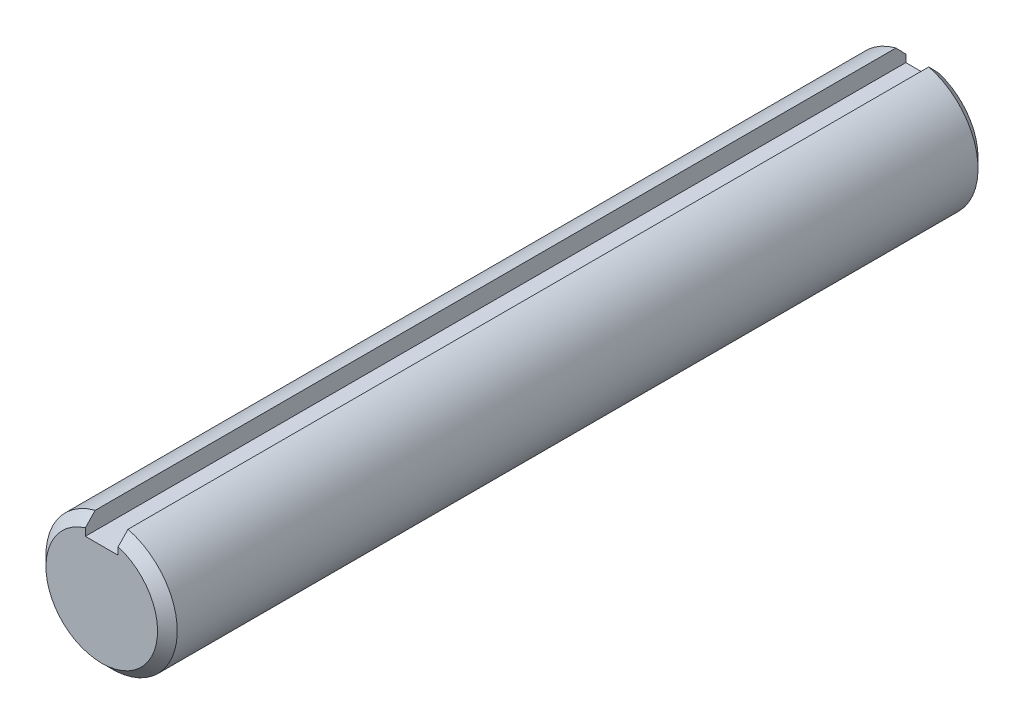
ISO-10303-21;
HEADER;
FILE_DESCRIPTION(('STEP AP214'),'2;1');
FILE_NAME('part.step','',(''),(''),'','','');
FILE_SCHEMA(('AUTOMOTIVE_DESIGN { 1 0 10303 214 1 1 1 1 }'));
ENDSEC;
DATA;
#1=APPLICATION_CONTEXT('core data for automotive mechanical design processes');
#2=APPLICATION_PROTOCOL_DEFINITION('international standard','automotive_design',2000,#1);
#3=PRODUCT_CONTEXT('',#1,'mechanical');
#4=PRODUCT('Part','Part','',(#3));
#5=PRODUCT_RELATED_PRODUCT_CATEGORY('part','',(#4));
#6=PRODUCT_DEFINITION_FORMATION('','',#4);
#7=PRODUCT_DEFINITION_CONTEXT('part definition',#1,'design');
#8=PRODUCT_DEFINITION('design','',#6,#7);
#9=PRODUCT_DEFINITION_SHAPE('','',#8);
#10=(LENGTH_UNIT() NAMED_UNIT(*) SI_UNIT(.MILLI.,.METRE.));
#11=(NAMED_UNIT(*) PLANE_ANGLE_UNIT() SI_UNIT($,.RADIAN.));
#12=(NAMED_UNIT(*) SI_UNIT($,.STERADIAN.) SOLID_ANGLE_UNIT());
#13=UNCERTAINTY_MEASURE_WITH_UNIT(LENGTH_MEASURE(1.E-05),#10,'distance_accuracy_value','');
#14=(GEOMETRIC_REPRESENTATION_CONTEXT(3) GLOBAL_UNCERTAINTY_ASSIGNED_CONTEXT((#13)) GLOBAL_UNIT_ASSIGNED_CONTEXT((#10,
#11,#12)) REPRESENTATION_CONTEXT('',''));
#15=CARTESIAN_POINT('',(0.,0.,0.));
#16=DIRECTION('',(0.,0.,1.));
#17=DIRECTION('',(1.,0.,0.));
#18=AXIS2_PLACEMENT_3D('',#15,#16,#17);
#19=CARTESIAN_POINT('',(0.,0.,25.));
#20=DIRECTION('',(0.,0.,-1.));
#21=DIRECTION('',(-1.,0.,0.));
#22=AXIS2_PLACEMENT_3D('',#19,#20,#21);
#23=CYLINDRICAL_SURFACE('',#22,4.);
#24=CARTESIAN_POINT('',(0.,0.,24.4));
#25=DIRECTION('',(0.,0.,1.));
#26=DIRECTION('',(1.,0.,0.));
#27=AXIS2_PLACEMENT_3D('',#24,#25,#26);
#28=CIRCLE('',#27,4.);
#29=CARTESIAN_POINT('',(1.,3.87298334620742,24.4));
#30=VERTEX_POINT('',#29);
#31=CARTESIAN_POINT('',(-1.,3.87298334620742,24.4));
#32=VERTEX_POINT('',#31);
#33=EDGE_CURVE('E154',#30,#32,#28,.F.);
#34=ORIENTED_EDGE('',*,*,#33,.T.);
#35=DIRECTION('',(0.,0.,-1.));
#36=VECTOR('',#35,1.);
#37=CARTESIAN_POINT('',(-1.,3.87298334620742,25.));
#38=LINE('',#37,#36);
#39=CARTESIAN_POINT('',(-1.,3.87298334620742,-24.4));
#40=VERTEX_POINT('',#39);
#41=EDGE_CURVE('E131',#32,#40,#38,.T.);
#42=ORIENTED_EDGE('',*,*,#41,.T.);
#43=CARTESIAN_POINT('',(0.,0.,-24.4));
#44=DIRECTION('',(0.,0.,1.));
#45=DIRECTION('',(1.,0.,0.));
#46=AXIS2_PLACEMENT_3D('',#43,#44,#45);
#47=CIRCLE('',#46,4.);
#48=CARTESIAN_POINT('',(1.,3.87298334620742,-24.4));
#49=VERTEX_POINT('',#48);
#50=EDGE_CURVE('E151',#40,#49,#47,.T.);
#51=ORIENTED_EDGE('',*,*,#50,.T.);
#52=DIRECTION('',(0.,0.,-1.));
#53=VECTOR('',#52,1.);
#54=CARTESIAN_POINT('',(1.,3.87298334620742,25.));
#55=LINE('',#54,#53);
#56=EDGE_CURVE('E120',#49,#30,#55,.F.);
#57=ORIENTED_EDGE('',*,*,#56,.T.);
#58=EDGE_LOOP('',(#34,#42,#51,#57));
#59=FACE_BOUND('',#58,.T.);
#60=ADVANCED_FACE('F34',(#59),#23,.T.);
#61=CARTESIAN_POINT('',(0.,0.,25.));
#62=DIRECTION('',(0.,0.,1.));
#63=DIRECTION('',(1.,0.,0.));
#64=AXIS2_PLACEMENT_3D('',#61,#62,#63);
#65=PLANE('',#64);
#66=DIRECTION('',(0.,-1.,0.));
#67=VECTOR('',#66,1.);
#68=CARTESIAN_POINT('',(-1.,4.,25.));
#69=LINE('',#68,#67);
#70=CARTESIAN_POINT('',(-1.,3.24961536185438,25.));
#71=VERTEX_POINT('',#70);
#72=CARTESIAN_POINT('',(-1.,2.8,25.));
#73=VERTEX_POINT('',#72);
#74=EDGE_CURVE('E90',#71,#73,#69,.T.);
#75=ORIENTED_EDGE('',*,*,#74,.F.);
#76=CARTESIAN_POINT('',(0.,0.,25.));
#77=DIRECTION('',(0.,0.,1.));
#78=DIRECTION('',(1.,0.,0.));
#79=AXIS2_PLACEMENT_3D('',#76,#77,#78);
#80=CIRCLE('',#79,3.4);
#81=CARTESIAN_POINT('',(1.,3.24961536185438,25.));
#82=VERTEX_POINT('',#81);
#83=EDGE_CURVE('E146',#71,#82,#80,.T.);
#84=ORIENTED_EDGE('',*,*,#83,.T.);
#85=DIRECTION('',(0.,1.,0.));
#86=VECTOR('',#85,1.);
#87=CARTESIAN_POINT('',(1.,4.,25.));
#88=LINE('',#87,#86);
#89=CARTESIAN_POINT('',(1.,2.8,25.));
#90=VERTEX_POINT('',#89);
#91=EDGE_CURVE('E55',#90,#82,#88,.T.);
#92=ORIENTED_EDGE('',*,*,#91,.F.);
#93=DIRECTION('',(1.,0.,0.));
#94=VECTOR('',#93,1.);
#95=CARTESIAN_POINT('',(-1.,2.8,25.));
#96=LINE('',#95,#94);
#97=EDGE_CURVE('E100',#73,#90,#96,.T.);
#98=ORIENTED_EDGE('',*,*,#97,.F.);
#99=EDGE_LOOP('',(#75,#84,#92,#98));
#100=FACE_BOUND('',#99,.T.);
#101=ADVANCED_FACE('F111',(#100),#65,.T.);
#102=CARTESIAN_POINT('',(0.,0.,-25.));
#103=DIRECTION('',(0.,0.,1.));
#104=DIRECTION('',(1.,0.,0.));
#105=AXIS2_PLACEMENT_3D('',#102,#103,#104);
#106=PLANE('',#105);
#107=CARTESIAN_POINT('',(0.,0.,-25.));
#108=DIRECTION('',(0.,0.,1.));
#109=DIRECTION('',(1.,0.,0.));
#110=AXIS2_PLACEMENT_3D('',#107,#108,#109);
#111=CIRCLE('',#110,3.39999999999999);
#112=CARTESIAN_POINT('',(1.,3.24961536185438,-25.));
#113=VERTEX_POINT('',#112);
#114=CARTESIAN_POINT('',(-1.,3.24961536185438,-25.));
#115=VERTEX_POINT('',#114);
#116=EDGE_CURVE('E148',#113,#115,#111,.F.);
#117=ORIENTED_EDGE('',*,*,#116,.T.);
#118=DIRECTION('',(0.,-1.,0.));
#119=VECTOR('',#118,1.);
#120=CARTESIAN_POINT('',(-1.,4.,-25.));
#121=LINE('',#120,#119);
#122=CARTESIAN_POINT('',(-1.,2.8,-25.));
#123=VERTEX_POINT('',#122);
#124=EDGE_CURVE('E113',#115,#123,#121,.T.);
#125=ORIENTED_EDGE('',*,*,#124,.T.);
#126=DIRECTION('',(1.,0.,0.));
#127=VECTOR('',#126,1.);
#128=CARTESIAN_POINT('',(-1.,2.8,-25.));
#129=LINE('',#128,#127);
#130=CARTESIAN_POINT('',(1.,2.8,-25.));
#131=VERTEX_POINT('',#130);
#132=EDGE_CURVE('E106',#123,#131,#129,.T.);
#133=ORIENTED_EDGE('',*,*,#132,.T.);
#134=DIRECTION('',(0.,1.,0.));
#135=VECTOR('',#134,1.);
#136=CARTESIAN_POINT('',(1.,4.,-25.));
#137=LINE('',#136,#135);
#138=EDGE_CURVE('E109',#131,#113,#137,.T.);
#139=ORIENTED_EDGE('',*,*,#138,.T.);
#140=EDGE_LOOP('',(#117,#125,#133,#139));
#141=FACE_BOUND('',#140,.T.);
#142=ADVANCED_FACE('F166',(#141),#106,.F.);
#143=CARTESIAN_POINT('',(0.,0.,-24.4));
#144=DIRECTION('',(0.,0.,1.));
#145=DIRECTION('',(1.,0.,0.));
#146=AXIS2_PLACEMENT_3D('',#143,#144,#145);
#147=CONICAL_SURFACE('',#146,4.,0.785398163397451);
#148=CARTESIAN_POINT('',(-1.,1.35081586044512,-26.7193145776707));
#149=CARTESIAN_POINT('',(-1.,1.41488066306062,-26.6677819180892));
#150=CARTESIAN_POINT('',(-1.,1.47834718315388,-26.6155190121442));
#151=CARTESIAN_POINT('',(-1.,1.60431909726052,-26.5098610895691));
#152=CARTESIAN_POINT('',(-1.,1.66682460819918,-26.4564662125761));
#153=CARTESIAN_POINT('',(-1.,1.79110830645551,-26.3488748489054));
#154=CARTESIAN_POINT('',(-1.,1.85288669062793,-26.2946785885891));
#155=CARTESIAN_POINT('',(-1.,1.97588779267709,-26.1856554471097));
#156=CARTESIAN_POINT('',(-1.,2.03711049082799,-26.1308285437153));
#157=CARTESIAN_POINT('',(-1.,2.22007183752193,-25.9656732576281));
#158=CARTESIAN_POINT('',(-1.,2.34115805740111,-25.8546228023411));
#159=CARTESIAN_POINT('',(-1.,2.58220273418876,-25.6312938836685));
#160=CARTESIAN_POINT('',(-1.,2.70216111581648,-25.5190153393776));
#161=CARTESIAN_POINT('',(-1.,2.90589091931233,-25.3269857063987));
#162=CARTESIAN_POINT('',(-1.,2.98986154396475,-25.2474457040524));
#163=CARTESIAN_POINT('',(-1.,3.15749767385885,-25.0880337926722));
#164=CARTESIAN_POINT('',(-1.,3.241163158339,-25.0081618618169));
#165=CARTESIAN_POINT('',(-1.,3.48509842555487,-24.7745671002813));
#166=CARTESIAN_POINT('',(-1.,3.64503682524598,-24.6204983050087));
#167=CARTESIAN_POINT('',(-1.,3.96429640051124,-24.311722329736));
#168=CARTESIAN_POINT('',(-1.,4.1236175738643,-24.1570151474428));
#169=CARTESIAN_POINT('',(-1.,4.44177985420495,-23.8471885210976));
#170=CARTESIAN_POINT('',(-1.,4.60062107239222,-23.6920691911779));
#171=CARTESIAN_POINT('',(-1.,4.91797030091099,-23.3814935510322));
#172=CARTESIAN_POINT('',(-1.,5.07647831497418,-23.2260372446202));
#173=CARTESIAN_POINT('',(-1.,5.23487471717617,-23.0704678156024));
#174=B_SPLINE_CURVE_WITH_KNOTS('',3,(#148,#149,#150,#151,#152,#153,#154,#155,#156,#157,#158,
#159,#160,#161,#162,#163,#164,#165,#166,#167,#168,#169,#170,#171,#172,#173),.UNSPECIFIED.,.F.,
.F.,(4,2,2,2,2,2,2,2,2,2,2,2,4),(0.,0.246638527108011,0.493246804550317,0.739786706664861,
0.986335326531218,1.47921612753496,1.97212959697096,2.31911430749397,2.66612220192962,
3.33234537153699,3.99857093633251,4.66462804467029,5.33067765339344),.UNSPECIFIED.);
#175=EDGE_CURVE('E63',#115,#40,#174,.T.);
#176=ORIENTED_EDGE('',*,*,#175,.F.);
#177=ORIENTED_EDGE('',*,*,#116,.F.);
#178=CARTESIAN_POINT('',(1.,5.23487471717617,-23.0704678156024));
#179=CARTESIAN_POINT('',(1.,5.07642976511734,-23.2260850635911));
#180=CARTESIAN_POINT('',(1.,4.91787303822036,-23.3815890063281));
#181=CARTESIAN_POINT('',(1.,4.60043442524243,-23.6922515783813));
#182=CARTESIAN_POINT('',(1.,4.44155255272162,-23.8474102215566));
#183=CARTESIAN_POINT('',(1.,4.12339792056105,-24.1572286939957));
#184=CARTESIAN_POINT('',(1.,3.96412529582628,-24.3118886617124));
#185=CARTESIAN_POINT('',(1.,3.64495454195615,-24.6205770374935));
#186=CARTESIAN_POINT('',(1.,3.48505638500136,-24.7746054168307));
#187=CARTESIAN_POINT('',(1.,3.16427810361861,-25.0817896736052));
#188=CARTESIAN_POINT('',(1.,3.00339754942277,-25.2349451025749));
#189=CARTESIAN_POINT('',(1.,2.68026393133356,-25.5397741705045));
#190=CARTESIAN_POINT('',(1.,2.51801101305171,-25.6914479630795));
#191=CARTESIAN_POINT('',(1.,2.27284509960378,-25.9170936253633));
#192=CARTESIAN_POINT('',(1.,2.19080682391783,-25.9920145563211));
#193=CARTESIAN_POINT('',(1.,2.02594222380101,-26.1409764949062));
#194=CARTESIAN_POINT('',(1.,1.94311594332784,-26.2150175511038));
#195=CARTESIAN_POINT('',(1.,1.77634824406913,-26.3619013656389));
#196=CARTESIAN_POINT('',(1.,1.69240642828067,-26.4347436755316));
#197=CARTESIAN_POINT('',(1.,1.56532637426185,-26.5426501770363));
#198=CARTESIAN_POINT('',(1.,1.52276776255762,-26.5783961330172));
#199=CARTESIAN_POINT('',(1.,1.43717223649482,-26.6493154130559));
#200=CARTESIAN_POINT('',(1.,1.39413529386853,-26.6844887029652));
#201=CARTESIAN_POINT('',(1.,1.35081586044512,-26.7193145776707));
#202=B_SPLINE_CURVE_WITH_KNOTS('',3,(#178,#179,#180,#181,#182,#183,#184,#185,#186,#187,#188,
#189,#190,#191,#192,#193,#194,#195,#196,#197,#198,#199,#200,#201),.UNSPECIFIED.,.F.,.F.,(4,2,2,
2,2,2,2,2,2,2,2,4),(0.,0.666254019876629,1.33248079806412,1.99850314258169,2.66455545185874,
3.33092366291564,3.99722203595524,4.33052034592893,4.66380017110566,4.99720196323078,
5.16393407836718,5.33067609975519),.UNSPECIFIED.);
#203=EDGE_CURVE('E124',#49,#113,#202,.T.);
#204=ORIENTED_EDGE('',*,*,#203,.F.);
#205=ORIENTED_EDGE('',*,*,#50,.F.);
#206=EDGE_LOOP('',(#176,#177,#204,#205));
#207=FACE_BOUND('',#206,.T.);
#208=ADVANCED_FACE('F133',(#207),#147,.T.);
#209=CARTESIAN_POINT('',(0.,0.,25.));
#210=DIRECTION('',(0.,0.,-1.));
#211=DIRECTION('',(-1.,0.,0.));
#212=AXIS2_PLACEMENT_3D('',#209,#210,#211);
#213=CONICAL_SURFACE('',#212,3.4,0.785398163397454);
#214=CARTESIAN_POINT('',(-1.,5.23487471717618,23.0704678156024));
#215=CARTESIAN_POINT('',(-1.,5.07642976511734,23.2260850635911));
#216=CARTESIAN_POINT('',(-1.,4.91787303822036,23.3815890063281));
#217=CARTESIAN_POINT('',(-1.,4.60043442524244,23.6922515783813));
#218=CARTESIAN_POINT('',(-1.,4.44155255272163,23.8474102215567));
#219=CARTESIAN_POINT('',(-1.,4.12339792056105,24.1572286939957));
#220=CARTESIAN_POINT('',(-1.,3.96412529582628,24.3118886617124));
#221=CARTESIAN_POINT('',(-1.,3.64495454195616,24.6205770374935));
#222=CARTESIAN_POINT('',(-1.,3.48505638500136,24.7746054168307));
#223=CARTESIAN_POINT('',(-1.,3.16427810361862,25.0817896736052));
#224=CARTESIAN_POINT('',(-1.,3.00339754942277,25.2349451025749));
#225=CARTESIAN_POINT('',(-1.,2.68026393133356,25.5397741705045));
#226=CARTESIAN_POINT('',(-1.,2.51801101305172,25.6914479630795));
#227=CARTESIAN_POINT('',(-1.,2.27284509960379,25.9170936253633));
#228=CARTESIAN_POINT('',(-1.,2.19080682391783,25.9920145563211));
#229=CARTESIAN_POINT('',(-1.,2.02594222380101,26.1409764949062));
#230=CARTESIAN_POINT('',(-1.,1.94311594332784,26.2150175511038));
#231=CARTESIAN_POINT('',(-1.,1.77634824406914,26.3619013656389));
#232=CARTESIAN_POINT('',(-1.,1.69240642828068,26.4347436755316));
#233=CARTESIAN_POINT('',(-1.,1.56532637426185,26.5426501770363));
#234=CARTESIAN_POINT('',(-1.,1.52276776255762,26.5783961330171));
#235=CARTESIAN_POINT('',(-1.,1.43717223649483,26.6493154130559));
#236=CARTESIAN_POINT('',(-1.,1.39413529386853,26.6844887029652));
#237=CARTESIAN_POINT('',(-1.,1.35081586044512,26.7193145776707));
#238=B_SPLINE_CURVE_WITH_KNOTS('',3,(#214,#215,#216,#217,#218,#219,#220,#221,#222,#223,#224,
#225,#226,#227,#228,#229,#230,#231,#232,#233,#234,#235,#236,#237),.UNSPECIFIED.,.F.,.F.,(4,2,2,
2,2,2,2,2,2,2,2,4),(0.,0.666254019876631,1.33248079806411,1.99850314258169,2.66455545185873,
3.33092366291563,3.99722203595523,4.33052034592892,4.66380017110564,4.99720196323077,
5.16393407836717,5.33067609975518),.UNSPECIFIED.);
#239=EDGE_CURVE('E11',#32,#71,#238,.T.);
#240=ORIENTED_EDGE('',*,*,#239,.F.);
#241=ORIENTED_EDGE('',*,*,#33,.F.);
#242=CARTESIAN_POINT('',(1.,1.35081586044512,26.7193145776707));
#243=CARTESIAN_POINT('',(1.,1.41488066306062,26.6677819180892));
#244=CARTESIAN_POINT('',(1.,1.47834718315388,26.6155190121442));
#245=CARTESIAN_POINT('',(1.,1.60431909726052,26.5098610895691));
#246=CARTESIAN_POINT('',(1.,1.66682460819919,26.4564662125761));
#247=CARTESIAN_POINT('',(1.,1.79110830645551,26.3488748489054));
#248=CARTESIAN_POINT('',(1.,1.85288669062793,26.2946785885891));
#249=CARTESIAN_POINT('',(1.,1.97588779267709,26.1856554471097));
#250=CARTESIAN_POINT('',(1.,2.03711049082799,26.1308285437153));
#251=CARTESIAN_POINT('',(1.,2.22007183752193,25.9656732576281));
#252=CARTESIAN_POINT('',(1.,2.34115805740112,25.8546228023411));
#253=CARTESIAN_POINT('',(1.,2.58220273418876,25.6312938836685));
#254=CARTESIAN_POINT('',(1.,2.70216111581648,25.5190153393776));
#255=CARTESIAN_POINT('',(1.,2.90589091931234,25.3269857063987));
#256=CARTESIAN_POINT('',(1.,2.98986154396475,25.2474457040524));
#257=CARTESIAN_POINT('',(1.,3.15749767385886,25.0880337926722));
#258=CARTESIAN_POINT('',(1.,3.24116315833901,25.0081618618169));
#259=CARTESIAN_POINT('',(1.,3.48509842555487,24.7745671002813));
#260=CARTESIAN_POINT('',(1.,3.64503682524599,24.6204983050087));
#261=CARTESIAN_POINT('',(1.,3.96429640051125,24.311722329736));
#262=CARTESIAN_POINT('',(1.,4.1236175738643,24.1570151474428));
#263=CARTESIAN_POINT('',(1.,4.44177985420495,23.8471885210976));
#264=CARTESIAN_POINT('',(1.,4.60062107239222,23.6920691911779));
#265=CARTESIAN_POINT('',(1.,4.91797030091099,23.3814935510322));
#266=CARTESIAN_POINT('',(1.,5.07647831497418,23.2260372446202));
#267=CARTESIAN_POINT('',(1.,5.23487471717618,23.0704678156024));
#268=B_SPLINE_CURVE_WITH_KNOTS('',3,(#242,#243,#244,#245,#246,#247,#248,#249,#250,#251,#252,
#253,#254,#255,#256,#257,#258,#259,#260,#261,#262,#263,#264,#265,#266,#267),.UNSPECIFIED.,.F.,
.F.,(4,2,2,2,2,2,2,2,2,2,2,2,4),(0.,0.246638527108011,0.493246804550315,0.739786706664859,
0.986335326531216,1.47921612753496,1.97212959697096,2.31911430749397,2.66612220192962,
3.33234537153699,3.9985709363325,4.66462804467028,5.33067765339343),.UNSPECIFIED.);
#269=EDGE_CURVE('E48',#82,#30,#268,.T.);
#270=ORIENTED_EDGE('',*,*,#269,.F.);
#271=ORIENTED_EDGE('',*,*,#83,.F.);
#272=EDGE_LOOP('',(#240,#241,#270,#271));
#273=FACE_BOUND('',#272,.T.);
#274=ADVANCED_FACE('F36',(#273),#213,.T.);
#275=CARTESIAN_POINT('',(-1.,4.,-25.));
#276=DIRECTION('',(-1.,0.,0.));
#277=DIRECTION('',(0.,-1.,0.));
#278=AXIS2_PLACEMENT_3D('',#275,#276,#277);
#279=PLANE('',#278);
#280=ORIENTED_EDGE('',*,*,#175,.T.);
#281=ORIENTED_EDGE('',*,*,#41,.F.);
#282=ORIENTED_EDGE('',*,*,#239,.T.);
#283=ORIENTED_EDGE('',*,*,#74,.T.);
#284=DIRECTION('',(0.,0.,1.));
#285=VECTOR('',#284,1.);
#286=CARTESIAN_POINT('',(-1.,2.8,-25.));
#287=LINE('',#286,#285);
#288=EDGE_CURVE('E93',#123,#73,#287,.T.);
#289=ORIENTED_EDGE('',*,*,#288,.F.);
#290=ORIENTED_EDGE('',*,*,#124,.F.);
#291=EDGE_LOOP('',(#280,#281,#282,#283,#289,#290));
#292=FACE_BOUND('',#291,.T.);
#293=ADVANCED_FACE('F92',(#292),#279,.F.);
#294=CARTESIAN_POINT('',(1.,4.,-25.));
#295=DIRECTION('',(1.,0.,0.));
#296=DIRECTION('',(0.,1.,0.));
#297=AXIS2_PLACEMENT_3D('',#294,#295,#296);
#298=PLANE('',#297);
#299=ORIENTED_EDGE('',*,*,#203,.T.);
#300=ORIENTED_EDGE('',*,*,#138,.F.);
#301=DIRECTION('',(0.,0.,1.));
#302=VECTOR('',#301,1.);
#303=CARTESIAN_POINT('',(1.,2.8,-25.));
#304=LINE('',#303,#302);
#305=EDGE_CURVE('E108',#131,#90,#304,.T.);
#306=ORIENTED_EDGE('',*,*,#305,.T.);
#307=ORIENTED_EDGE('',*,*,#91,.T.);
#308=ORIENTED_EDGE('',*,*,#269,.T.);
#309=ORIENTED_EDGE('',*,*,#56,.F.);
#310=EDGE_LOOP('',(#299,#300,#306,#307,#308,#309));
#311=FACE_BOUND('',#310,.T.);
#312=ADVANCED_FACE('F136',(#311),#298,.F.);
#313=CARTESIAN_POINT('',(-1.,2.8,-25.));
#314=DIRECTION('',(0.,-1.,0.));
#315=DIRECTION('',(0.,0.,-1.));
#316=AXIS2_PLACEMENT_3D('',#313,#314,#315);
#317=PLANE('',#316);
#318=ORIENTED_EDGE('',*,*,#305,.F.);
#319=ORIENTED_EDGE('',*,*,#132,.F.);
#320=ORIENTED_EDGE('',*,*,#288,.T.);
#321=ORIENTED_EDGE('',*,*,#97,.T.);
#322=EDGE_LOOP('',(#318,#319,#320,#321));
#323=FACE_BOUND('',#322,.T.);
#324=ADVANCED_FACE('F104',(#323),#317,.F.);
#325=CLOSED_SHELL('',(#60,#101,#142,#208,#274,#293,#312,#324));
#326=MANIFOLD_SOLID_BREP('B2',#325);
#327=ADVANCED_BREP_SHAPE_REPRESENTATION('',(#18,#326),#14);
#328=SHAPE_DEFINITION_REPRESENTATION(#9,#327);
ENDSEC;
END-ISO-10303-21;
